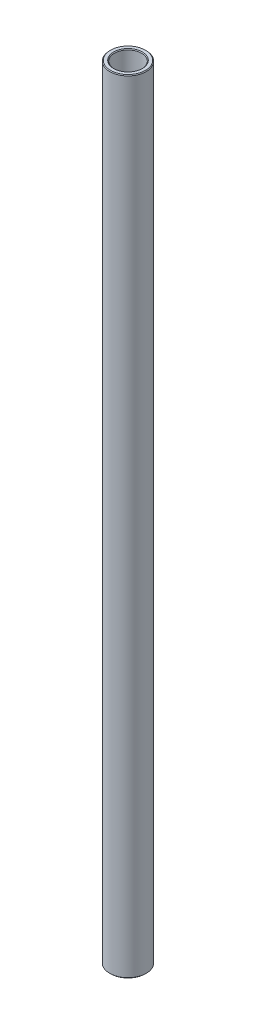
ISO-10303-21;
HEADER;
FILE_DESCRIPTION(('STEP AP214'),'2;1');
FILE_NAME('part.step','',(''),(''),'','','');
FILE_SCHEMA(('AUTOMOTIVE_DESIGN { 1 0 10303 214 1 1 1 1 }'));
ENDSEC;
DATA;
#1=APPLICATION_CONTEXT('core data for automotive mechanical design processes');
#2=APPLICATION_PROTOCOL_DEFINITION('international standard','automotive_design',2000,#1);
#3=PRODUCT_CONTEXT('',#1,'mechanical');
#4=PRODUCT('Part','Part','',(#3));
#5=PRODUCT_RELATED_PRODUCT_CATEGORY('part','',(#4));
#6=PRODUCT_DEFINITION_FORMATION('','',#4);
#7=PRODUCT_DEFINITION_CONTEXT('part definition',#1,'design');
#8=PRODUCT_DEFINITION('design','',#6,#7);
#9=PRODUCT_DEFINITION_SHAPE('','',#8);
#10=(LENGTH_UNIT() NAMED_UNIT(*) SI_UNIT(.MILLI.,.METRE.));
#11=(NAMED_UNIT(*) PLANE_ANGLE_UNIT() SI_UNIT($,.RADIAN.));
#12=(NAMED_UNIT(*) SI_UNIT($,.STERADIAN.) SOLID_ANGLE_UNIT());
#13=UNCERTAINTY_MEASURE_WITH_UNIT(LENGTH_MEASURE(1.E-05),#10,'distance_accuracy_value','');
#14=(GEOMETRIC_REPRESENTATION_CONTEXT(3) GLOBAL_UNCERTAINTY_ASSIGNED_CONTEXT((#13)) GLOBAL_UNIT_ASSIGNED_CONTEXT((#10,
#11,#12)) REPRESENTATION_CONTEXT('',''));
#15=CARTESIAN_POINT('',(0.,0.,0.));
#16=DIRECTION('',(0.,0.,1.));
#17=DIRECTION('',(1.,0.,0.));
#18=AXIS2_PLACEMENT_3D('',#15,#16,#17);
#19=CARTESIAN_POINT('',(0.,11.60859375,0.));
#20=DIRECTION('',(0.,1.,0.));
#21=DIRECTION('',(-1.,0.,0.));
#22=AXIS2_PLACEMENT_3D('',#19,#20,#21);
#23=CYLINDRICAL_SURFACE('',#22,4.7625);
#24=CARTESIAN_POINT('',(0.,-136.271,0.));
#25=DIRECTION('',(0.,1.,0.));
#26=DIRECTION('',(-1.,0.,0.));
#27=AXIS2_PLACEMENT_3D('',#24,#25,#26);
#28=CIRCLE('',#27,4.7625);
#29=CARTESIAN_POINT('',(-4.76250000000002,-136.271,0.));
#30=VERTEX_POINT('',#29);
#31=EDGE_CURVE('E54',#30,#30,#28,.F.);
#32=ORIENTED_EDGE('',*,*,#31,.T.);
#33=EDGE_LOOP('',(#32));
#34=FACE_BOUND('',#33,.T.);
#35=CARTESIAN_POINT('',(0.,136.271,0.));
#36=DIRECTION('',(0.,-1.,0.));
#37=DIRECTION('',(1.,0.,0.));
#38=AXIS2_PLACEMENT_3D('',#35,#36,#37);
#39=CIRCLE('',#38,4.7625);
#40=CARTESIAN_POINT('',(4.76250000000002,136.271,0.));
#41=VERTEX_POINT('',#40);
#42=EDGE_CURVE('E57',#41,#41,#39,.F.);
#43=ORIENTED_EDGE('',*,*,#42,.T.);
#44=EDGE_LOOP('',(#43));
#45=FACE_BOUND('',#44,.T.);
#46=ADVANCED_FACE('F34',(#34,#45),#23,.F.);
#47=CARTESIAN_POINT('',(4.76249999999998,136.525,0.));
#48=DIRECTION('',(0.,-1.,0.));
#49=DIRECTION('',(1.,0.,0.));
#50=AXIS2_PLACEMENT_3D('',#47,#48,#49);
#51=PLANE('',#50);
#52=CARTESIAN_POINT('',(0.,136.525,0.));
#53=DIRECTION('',(0.,-1.,0.));
#54=DIRECTION('',(1.,0.,0.));
#55=AXIS2_PLACEMENT_3D('',#52,#53,#54);
#56=CIRCLE('',#55,6.09599999999991);
#57=CARTESIAN_POINT('',(6.09599999999992,136.525,0.));
#58=VERTEX_POINT('',#57);
#59=EDGE_CURVE('E10',#58,#58,#56,.F.);
#60=ORIENTED_EDGE('',*,*,#59,.T.);
#61=EDGE_LOOP('',(#60));
#62=FACE_BOUND('',#61,.T.);
#63=CARTESIAN_POINT('',(0.,136.525,0.));
#64=DIRECTION('',(0.,-1.,0.));
#65=DIRECTION('',(1.,0.,0.));
#66=AXIS2_PLACEMENT_3D('',#63,#64,#65);
#67=CIRCLE('',#66,5.01650000000001);
#68=CARTESIAN_POINT('',(5.01650000000003,136.525,0.));
#69=VERTEX_POINT('',#68);
#70=EDGE_CURVE('E41',#69,#69,#67,.T.);
#71=ORIENTED_EDGE('',*,*,#70,.T.);
#72=EDGE_LOOP('',(#71));
#73=FACE_BOUND('',#72,.T.);
#74=ADVANCED_FACE('F80',(#62,#73),#51,.F.);
#75=CARTESIAN_POINT('',(0.,11.60859375,0.));
#76=DIRECTION('',(0.,1.,0.));
#77=DIRECTION('',(-1.,0.,0.));
#78=AXIS2_PLACEMENT_3D('',#75,#76,#77);
#79=CYLINDRICAL_SURFACE('',#78,6.35);
#80=CARTESIAN_POINT('',(0.,-136.271,0.));
#81=DIRECTION('',(0.,1.,0.));
#82=DIRECTION('',(-1.,0.,0.));
#83=AXIS2_PLACEMENT_3D('',#80,#81,#82);
#84=CIRCLE('',#83,6.35);
#85=CARTESIAN_POINT('',(-6.35000000000002,-136.271,0.));
#86=VERTEX_POINT('',#85);
#87=EDGE_CURVE('E45',#86,#86,#84,.T.);
#88=ORIENTED_EDGE('',*,*,#87,.T.);
#89=EDGE_LOOP('',(#88));
#90=FACE_BOUND('',#89,.T.);
#91=CARTESIAN_POINT('',(0.,136.271,0.));
#92=DIRECTION('',(0.,-1.,0.));
#93=DIRECTION('',(1.,0.,0.));
#94=AXIS2_PLACEMENT_3D('',#91,#92,#93);
#95=CIRCLE('',#94,6.35);
#96=CARTESIAN_POINT('',(6.35000000000002,136.271,0.));
#97=VERTEX_POINT('',#96);
#98=EDGE_CURVE('E49',#97,#97,#95,.T.);
#99=ORIENTED_EDGE('',*,*,#98,.T.);
#100=EDGE_LOOP('',(#99));
#101=FACE_BOUND('',#100,.T.);
#102=ADVANCED_FACE('F77',(#90,#101),#79,.T.);
#103=CARTESIAN_POINT('',(6.35000000000002,-136.525,0.));
#104=DIRECTION('',(0.,1.,0.));
#105=DIRECTION('',(-1.,0.,0.));
#106=AXIS2_PLACEMENT_3D('',#103,#104,#105);
#107=PLANE('',#106);
#108=CARTESIAN_POINT('',(0.,-136.525,0.));
#109=DIRECTION('',(0.,1.,0.));
#110=DIRECTION('',(-1.,0.,0.));
#111=AXIS2_PLACEMENT_3D('',#108,#109,#110);
#112=CIRCLE('',#111,5.01649999999998);
#113=CARTESIAN_POINT('',(-5.01649999999999,-136.525,0.));
#114=VERTEX_POINT('',#113);
#115=EDGE_CURVE('E60',#114,#114,#112,.T.);
#116=ORIENTED_EDGE('',*,*,#115,.T.);
#117=EDGE_LOOP('',(#116));
#118=FACE_BOUND('',#117,.T.);
#119=CARTESIAN_POINT('',(0.,-136.525,0.));
#120=DIRECTION('',(0.,1.,0.));
#121=DIRECTION('',(-1.,0.,0.));
#122=AXIS2_PLACEMENT_3D('',#119,#120,#121);
#123=CIRCLE('',#122,6.09599999999999);
#124=CARTESIAN_POINT('',(-6.09600000000001,-136.525,0.));
#125=VERTEX_POINT('',#124);
#126=EDGE_CURVE('E63',#125,#125,#123,.F.);
#127=ORIENTED_EDGE('',*,*,#126,.T.);
#128=EDGE_LOOP('',(#127));
#129=FACE_BOUND('',#128,.T.);
#130=ADVANCED_FACE('F67',(#118,#129),#107,.F.);
#131=CARTESIAN_POINT('',(0.,-136.525,0.));
#132=DIRECTION('',(0.,-1.,0.));
#133=DIRECTION('',(1.,0.,0.));
#134=AXIS2_PLACEMENT_3D('',#131,#132,#133);
#135=CONICAL_SURFACE('',#134,5.01649999999998,0.785398163397453);
#136=ORIENTED_EDGE('',*,*,#31,.F.);
#137=EDGE_LOOP('',(#136));
#138=FACE_BOUND('',#137,.T.);
#139=ORIENTED_EDGE('',*,*,#115,.F.);
#140=EDGE_LOOP('',(#139));
#141=FACE_BOUND('',#140,.T.);
#142=ADVANCED_FACE('F73',(#138,#141),#135,.F.);
#143=CARTESIAN_POINT('',(0.,-136.271,0.));
#144=DIRECTION('',(0.,1.,0.));
#145=DIRECTION('',(-1.,0.,0.));
#146=AXIS2_PLACEMENT_3D('',#143,#144,#145);
#147=CONICAL_SURFACE('',#146,6.35,0.785398163397515);
#148=ORIENTED_EDGE('',*,*,#126,.F.);
#149=EDGE_LOOP('',(#148));
#150=FACE_BOUND('',#149,.T.);
#151=ORIENTED_EDGE('',*,*,#87,.F.);
#152=EDGE_LOOP('',(#151));
#153=FACE_BOUND('',#152,.T.);
#154=ADVANCED_FACE('F69',(#150,#153),#147,.T.);
#155=CARTESIAN_POINT('',(0.,136.525,0.));
#156=DIRECTION('',(0.,-1.,0.));
#157=DIRECTION('',(1.,0.,0.));
#158=AXIS2_PLACEMENT_3D('',#155,#156,#157);
#159=CONICAL_SURFACE('',#158,6.09599999999991,0.785398163397406);
#160=ORIENTED_EDGE('',*,*,#98,.F.);
#161=EDGE_LOOP('',(#160));
#162=FACE_BOUND('',#161,.T.);
#163=ORIENTED_EDGE('',*,*,#59,.F.);
#164=EDGE_LOOP('',(#163));
#165=FACE_BOUND('',#164,.T.);
#166=ADVANCED_FACE('F72',(#162,#165),#159,.T.);
#167=CARTESIAN_POINT('',(0.,136.271,0.));
#168=DIRECTION('',(0.,1.,0.));
#169=DIRECTION('',(-1.,0.,0.));
#170=AXIS2_PLACEMENT_3D('',#167,#168,#169);
#171=CONICAL_SURFACE('',#170,4.7625,0.785398163397508);
#172=ORIENTED_EDGE('',*,*,#70,.F.);
#173=EDGE_LOOP('',(#172));
#174=FACE_BOUND('',#173,.T.);
#175=ORIENTED_EDGE('',*,*,#42,.F.);
#176=EDGE_LOOP('',(#175));
#177=FACE_BOUND('',#176,.T.);
#178=ADVANCED_FACE('F36',(#174,#177),#171,.F.);
#179=CLOSED_SHELL('',(#46,#74,#102,#130,#142,#154,#166,#178));
#180=MANIFOLD_SOLID_BREP('B2',#179);
#181=ADVANCED_BREP_SHAPE_REPRESENTATION('',(#18,#180),#14);
#182=SHAPE_DEFINITION_REPRESENTATION(#9,#181);
ENDSEC;
END-ISO-10303-21;
